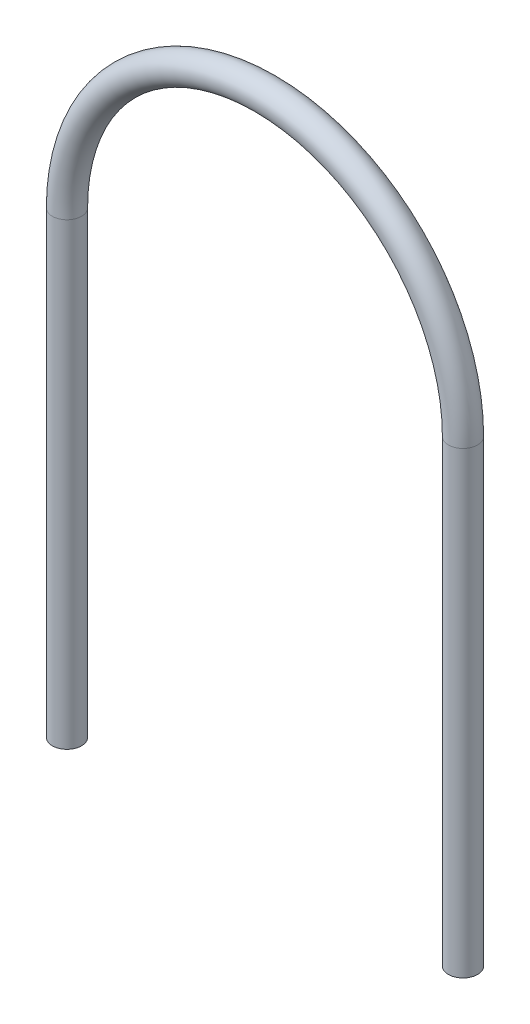
ISO-10303-21;
HEADER;
FILE_DESCRIPTION(('STEP AP214'),'2;1');
FILE_NAME('part.step','',(''),(''),'','','');
FILE_SCHEMA(('AUTOMOTIVE_DESIGN { 1 0 10303 214 1 1 1 1 }'));
ENDSEC;
DATA;
#1=APPLICATION_CONTEXT('core data for automotive mechanical design processes');
#2=APPLICATION_PROTOCOL_DEFINITION('international standard','automotive_design',2000,#1);
#3=PRODUCT_CONTEXT('',#1,'mechanical');
#4=PRODUCT('Part','Part','',(#3));
#5=PRODUCT_RELATED_PRODUCT_CATEGORY('part','',(#4));
#6=PRODUCT_DEFINITION_FORMATION('','',#4);
#7=PRODUCT_DEFINITION_CONTEXT('part definition',#1,'design');
#8=PRODUCT_DEFINITION('design','',#6,#7);
#9=PRODUCT_DEFINITION_SHAPE('','',#8);
#10=(LENGTH_UNIT() NAMED_UNIT(*) SI_UNIT(.MILLI.,.METRE.));
#11=(NAMED_UNIT(*) PLANE_ANGLE_UNIT() SI_UNIT($,.RADIAN.));
#12=(NAMED_UNIT(*) SI_UNIT($,.STERADIAN.) SOLID_ANGLE_UNIT());
#13=UNCERTAINTY_MEASURE_WITH_UNIT(LENGTH_MEASURE(1.E-05),#10,'distance_accuracy_value','');
#14=(GEOMETRIC_REPRESENTATION_CONTEXT(3) GLOBAL_UNCERTAINTY_ASSIGNED_CONTEXT((#13)) GLOBAL_UNIT_ASSIGNED_CONTEXT((#10,
#11,#12)) REPRESENTATION_CONTEXT('',''));
#15=CARTESIAN_POINT('',(0.,0.,0.));
#16=DIRECTION('',(0.,0.,1.));
#17=DIRECTION('',(1.,0.,0.));
#18=AXIS2_PLACEMENT_3D('',#15,#16,#17);
#19=CARTESIAN_POINT('',(0.,0.,0.));
#20=DIRECTION('',(0.,1.,0.));
#21=DIRECTION('',(0.,0.,1.));
#22=AXIS2_PLACEMENT_3D('',#19,#20,#21);
#23=PLANE('',#22);
#24=CARTESIAN_POINT('',(0.,0.,0.));
#25=DIRECTION('',(0.,1.,0.));
#26=DIRECTION('',(0.,0.,1.));
#27=AXIS2_PLACEMENT_3D('',#24,#25,#26);
#28=CIRCLE('',#27,2.0193);
#29=CARTESIAN_POINT('',(0.,0.,2.0193));
#30=VERTEX_POINT('',#29);
#31=EDGE_CURVE('E54',#30,#30,#28,.T.);
#32=ORIENTED_EDGE('',*,*,#31,.F.);
#33=EDGE_LOOP('',(#32));
#34=FACE_BOUND('',#33,.T.);
#35=ADVANCED_FACE('F37',(#34),#23,.F.);
#36=CARTESIAN_POINT('',(54.8386,0.,0.));
#37=DIRECTION('',(0.,-1.,0.));
#38=DIRECTION('',(0.,0.,1.));
#39=AXIS2_PLACEMENT_3D('',#36,#37,#38);
#40=PLANE('',#39);
#41=CARTESIAN_POINT('',(54.8386,0.,0.));
#42=DIRECTION('',(0.,-1.,0.));
#43=DIRECTION('',(0.,0.,1.));
#44=AXIS2_PLACEMENT_3D('',#41,#42,#43);
#45=CIRCLE('',#44,2.0193);
#46=CARTESIAN_POINT('',(54.8386,0.,2.0193));
#47=VERTEX_POINT('',#46);
#48=EDGE_CURVE('E10',#47,#47,#45,.T.);
#49=ORIENTED_EDGE('',*,*,#48,.T.);
#50=EDGE_LOOP('',(#49));
#51=FACE_BOUND('',#50,.T.);
#52=ADVANCED_FACE('F64',(#51),#40,.T.);
#53=CARTESIAN_POINT('',(0.,0.,0.));
#54=DIRECTION('',(0.,1.,0.));
#55=DIRECTION('',(0.,0.,1.));
#56=AXIS2_PLACEMENT_3D('',#53,#54,#55);
#57=CYLINDRICAL_SURFACE('',#56,2.0193);
#58=CARTESIAN_POINT('',(0.,63.5,0.));
#59=DIRECTION('',(0.,1.,0.));
#60=DIRECTION('',(0.,0.,1.));
#61=AXIS2_PLACEMENT_3D('',#58,#59,#60);
#62=CIRCLE('',#61,2.0193);
#63=CARTESIAN_POINT('',(-2.0193,63.5,0.));
#64=VERTEX_POINT('',#63);
#65=EDGE_CURVE('E49',#64,#64,#62,.T.);
#66=ORIENTED_EDGE('',*,*,#65,.F.);
#67=EDGE_LOOP('',(#66));
#68=FACE_BOUND('',#67,.T.);
#69=ORIENTED_EDGE('',*,*,#31,.T.);
#70=EDGE_LOOP('',(#69));
#71=FACE_BOUND('',#70,.T.);
#72=ADVANCED_FACE('F61',(#68,#71),#57,.T.);
#73=CARTESIAN_POINT('',(27.4193,63.5,0.));
#74=DIRECTION('',(0.,0.,-1.));
#75=DIRECTION('',(-1.,0.,0.));
#76=AXIS2_PLACEMENT_3D('',#73,#74,#75);
#77=TOROIDAL_SURFACE('',#76,27.4193,2.0193);
#78=CARTESIAN_POINT('',(54.8386,63.5,0.));
#79=DIRECTION('',(0.,-1.,0.));
#80=DIRECTION('',(0.,0.,1.));
#81=AXIS2_PLACEMENT_3D('',#78,#79,#80);
#82=CIRCLE('',#81,2.0193);
#83=CARTESIAN_POINT('',(56.8579,63.5,0.));
#84=VERTEX_POINT('',#83);
#85=EDGE_CURVE('E44',#84,#84,#82,.T.);
#86=CARTESIAN_POINT('',(27.4193,63.5,0.));
#87=DIRECTION('',(0.,0.,-1.));
#88=DIRECTION('',(-1.,0.,0.));
#89=AXIS2_PLACEMENT_3D('',#86,#87,#88);
#90=CIRCLE('',#89,29.4386);
#91=EDGE_CURVE('',#64,#84,#90,.T.);
#92=ORIENTED_EDGE('',*,*,#65,.T.);
#93=ORIENTED_EDGE('',*,*,#85,.F.);
#94=ORIENTED_EDGE('',*,*,#91,.T.);
#95=ORIENTED_EDGE('',*,*,#91,.F.);
#96=EDGE_LOOP('',(#92,#94,#93,#95));
#97=FACE_BOUND('',#96,.T.);
#98=ADVANCED_FACE('F70',(#97),#77,.T.);
#99=CARTESIAN_POINT('',(54.8386,63.5,0.));
#100=DIRECTION('',(0.,-1.,0.));
#101=DIRECTION('',(0.,0.,-1.));
#102=AXIS2_PLACEMENT_3D('',#99,#100,#101);
#103=CYLINDRICAL_SURFACE('',#102,2.0193);
#104=ORIENTED_EDGE('',*,*,#48,.F.);
#105=EDGE_LOOP('',(#104));
#106=FACE_BOUND('',#105,.T.);
#107=ORIENTED_EDGE('',*,*,#85,.T.);
#108=EDGE_LOOP('',(#107));
#109=FACE_BOUND('',#108,.T.);
#110=ADVANCED_FACE('F68',(#106,#109),#103,.T.);
#111=CLOSED_SHELL('',(#35,#52,#72,#98,#110));
#112=MANIFOLD_SOLID_BREP('B2',#111);
#113=ADVANCED_BREP_SHAPE_REPRESENTATION('',(#18,#112),#14);
#114=SHAPE_DEFINITION_REPRESENTATION(#9,#113);
ENDSEC;
END-ISO-10303-21;
